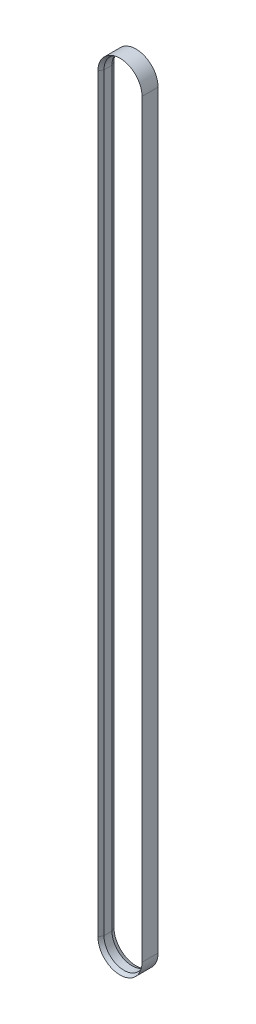
ISO-10303-21;
HEADER;
FILE_DESCRIPTION(('STEP AP214'),'2;1');
FILE_NAME('part.step','',(''),(''),'','','');
FILE_SCHEMA(('AUTOMOTIVE_DESIGN { 1 0 10303 214 1 1 1 1 }'));
ENDSEC;
DATA;
#1=APPLICATION_CONTEXT('core data for automotive mechanical design processes');
#2=APPLICATION_PROTOCOL_DEFINITION('international standard','automotive_design',2000,#1);
#3=PRODUCT_CONTEXT('',#1,'mechanical');
#4=PRODUCT('Part','Part','',(#3));
#5=PRODUCT_RELATED_PRODUCT_CATEGORY('part','',(#4));
#6=PRODUCT_DEFINITION_FORMATION('','',#4);
#7=PRODUCT_DEFINITION_CONTEXT('part definition',#1,'design');
#8=PRODUCT_DEFINITION('design','',#6,#7);
#9=PRODUCT_DEFINITION_SHAPE('','',#8);
#10=(LENGTH_UNIT() NAMED_UNIT(*) SI_UNIT(.MILLI.,.METRE.));
#11=(NAMED_UNIT(*) PLANE_ANGLE_UNIT() SI_UNIT($,.RADIAN.));
#12=(NAMED_UNIT(*) SI_UNIT($,.STERADIAN.) SOLID_ANGLE_UNIT());
#13=UNCERTAINTY_MEASURE_WITH_UNIT(LENGTH_MEASURE(1.E-05),#10,'distance_accuracy_value','');
#14=(GEOMETRIC_REPRESENTATION_CONTEXT(3) GLOBAL_UNCERTAINTY_ASSIGNED_CONTEXT((#13)) GLOBAL_UNIT_ASSIGNED_CONTEXT((#10,
#11,#12)) REPRESENTATION_CONTEXT('',''));
#15=CARTESIAN_POINT('',(0.,0.,0.));
#16=DIRECTION('',(0.,0.,1.));
#17=DIRECTION('',(1.,0.,0.));
#18=AXIS2_PLACEMENT_3D('',#15,#16,#17);
#19=CARTESIAN_POINT('',(27.5000000000167,-935.500000000115,10.));
#20=DIRECTION('',(1.,0.,0.));
#21=DIRECTION('',(0.,0.,-1.));
#22=AXIS2_PLACEMENT_3D('',#19,#20,#21);
#23=PLANE('',#22);
#24=DIRECTION('',(0.,1.,0.));
#25=VECTOR('',#24,1.);
#26=CARTESIAN_POINT('',(27.5000000000167,-935.500000000115,10.));
#27=LINE('',#26,#25);
#28=CARTESIAN_POINT('',(27.5000000000167,-935.500000000116,10.));
#29=VERTEX_POINT('',#28);
#30=CARTESIAN_POINT('',(27.5000000000167,0.,10.));
#31=VERTEX_POINT('',#30);
#32=EDGE_CURVE('E11',#29,#31,#27,.T.);
#33=ORIENTED_EDGE('',*,*,#32,.F.);
#34=DIRECTION('',(0.,0.,-1.));
#35=VECTOR('',#34,1.);
#36=CARTESIAN_POINT('',(27.5000000000167,-935.500000000116,10.));
#37=LINE('',#36,#35);
#38=CARTESIAN_POINT('',(27.5000000000167,-935.500000000116,-10.));
#39=VERTEX_POINT('',#38);
#40=EDGE_CURVE('E43',#29,#39,#37,.T.);
#41=ORIENTED_EDGE('',*,*,#40,.T.);
#42=DIRECTION('',(0.,1.,0.));
#43=VECTOR('',#42,1.);
#44=CARTESIAN_POINT('',(27.5000000000167,-935.500000000115,-10.));
#45=LINE('',#44,#43);
#46=CARTESIAN_POINT('',(27.5000000000167,0.,-10.));
#47=VERTEX_POINT('',#46);
#48=EDGE_CURVE('E128',#39,#47,#45,.T.);
#49=ORIENTED_EDGE('',*,*,#48,.T.);
#50=DIRECTION('',(0.,0.,-1.));
#51=VECTOR('',#50,1.);
#52=CARTESIAN_POINT('',(27.5000000000167,0.,10.));
#53=LINE('',#52,#51);
#54=EDGE_CURVE('E131',#31,#47,#53,.T.);
#55=ORIENTED_EDGE('',*,*,#54,.F.);
#56=EDGE_LOOP('',(#33,#41,#49,#55));
#57=FACE_BOUND('',#56,.T.);
#58=ADVANCED_FACE('F40',(#57),#23,.T.);
#59=CARTESIAN_POINT('',(25.0000000000166,-935.500000000115,5.));
#60=DIRECTION('',(-0.894427190999916,0.,0.447213595499959));
#61=DIRECTION('',(0.447213595499959,0.,0.894427190999916));
#62=AXIS2_PLACEMENT_3D('',#59,#60,#61);
#63=PLANE('',#62);
#64=DIRECTION('',(0.,1.,0.));
#65=VECTOR('',#64,1.);
#66=CARTESIAN_POINT('',(25.0000000000166,-935.500000000115,5.));
#67=LINE('',#66,#65);
#68=CARTESIAN_POINT('',(25.0000000000166,-935.500000000116,5.));
#69=VERTEX_POINT('',#68);
#70=CARTESIAN_POINT('',(25.0000000000166,0.,5.));
#71=VERTEX_POINT('',#70);
#72=EDGE_CURVE('E48',#69,#71,#67,.T.);
#73=ORIENTED_EDGE('',*,*,#72,.F.);
#74=DIRECTION('',(0.447213595499959,0.,0.894427190999916));
#75=VECTOR('',#74,1.);
#76=CARTESIAN_POINT('',(25.0000000000166,-935.500000000116,5.));
#77=LINE('',#76,#75);
#78=EDGE_CURVE('E198',#69,#29,#77,.T.);
#79=ORIENTED_EDGE('',*,*,#78,.T.);
#80=ORIENTED_EDGE('',*,*,#32,.T.);
#81=DIRECTION('',(0.447213595499959,0.,0.894427190999916));
#82=VECTOR('',#81,1.);
#83=CARTESIAN_POINT('',(25.0000000000166,0.,5.));
#84=LINE('',#83,#82);
#85=EDGE_CURVE('E156',#71,#31,#84,.T.);
#86=ORIENTED_EDGE('',*,*,#85,.F.);
#87=EDGE_LOOP('',(#73,#79,#80,#86));
#88=FACE_BOUND('',#87,.T.);
#89=ADVANCED_FACE('F222',(#88),#63,.T.);
#90=CARTESIAN_POINT('',(25.0000000000166,-935.500000000115,-5.));
#91=DIRECTION('',(-1.,0.,0.));
#92=DIRECTION('',(0.,0.,1.));
#93=AXIS2_PLACEMENT_3D('',#90,#91,#92);
#94=PLANE('',#93);
#95=DIRECTION('',(0.,1.,0.));
#96=VECTOR('',#95,1.);
#97=CARTESIAN_POINT('',(25.0000000000166,-935.500000000115,-5.));
#98=LINE('',#97,#96);
#99=CARTESIAN_POINT('',(25.0000000000166,-935.500000000116,-5.));
#100=VERTEX_POINT('',#99);
#101=CARTESIAN_POINT('',(25.0000000000166,0.,-5.));
#102=VERTEX_POINT('',#101);
#103=EDGE_CURVE('E137',#100,#102,#98,.T.);
#104=ORIENTED_EDGE('',*,*,#103,.F.);
#105=DIRECTION('',(0.,0.,1.));
#106=VECTOR('',#105,1.);
#107=CARTESIAN_POINT('',(25.0000000000166,-935.500000000116,-5.));
#108=LINE('',#107,#106);
#109=EDGE_CURVE('E182',#100,#69,#108,.T.);
#110=ORIENTED_EDGE('',*,*,#109,.T.);
#111=ORIENTED_EDGE('',*,*,#72,.T.);
#112=DIRECTION('',(0.,0.,1.));
#113=VECTOR('',#112,1.);
#114=CARTESIAN_POINT('',(25.0000000000166,0.,-5.));
#115=LINE('',#114,#113);
#116=EDGE_CURVE('E160',#102,#71,#115,.T.);
#117=ORIENTED_EDGE('',*,*,#116,.F.);
#118=EDGE_LOOP('',(#104,#110,#111,#117));
#119=FACE_BOUND('',#118,.T.);
#120=ADVANCED_FACE('F227',(#119),#94,.T.);
#121=CARTESIAN_POINT('',(5.99520433297585E-12,-935.500000000016,0.));
#122=DIRECTION('',(0.,0.,1.));
#123=DIRECTION('',(1.,0.,0.));
#124=AXIS2_PLACEMENT_3D('',#121,#122,#123);
#125=CYLINDRICAL_SURFACE('',#124,27.5000000000107);
#126=ORIENTED_EDGE('',*,*,#40,.F.);
#127=CARTESIAN_POINT('',(5.99520433297585E-12,-935.500000000016,10.));
#128=DIRECTION('',(0.,0.,1.));
#129=DIRECTION('',(-1.,3.62941999686411E-12,0.));
#130=AXIS2_PLACEMENT_3D('',#127,#128,#129);
#131=CIRCLE('',#130,27.5000000000107);
#132=CARTESIAN_POINT('',(-27.5000000000167,-935.499999999916,10.));
#133=VERTEX_POINT('',#132);
#134=EDGE_CURVE('E84',#133,#29,#131,.T.);
#135=ORIENTED_EDGE('',*,*,#134,.F.);
#136=DIRECTION('',(0.,0.,-1.));
#137=VECTOR('',#136,1.);
#138=CARTESIAN_POINT('',(-27.5000000000047,-935.499999999916,10.));
#139=LINE('',#138,#137);
#140=CARTESIAN_POINT('',(-27.5000000000167,-935.499999999916,-10.));
#141=VERTEX_POINT('',#140);
#142=EDGE_CURVE('E185',#133,#141,#139,.T.);
#143=ORIENTED_EDGE('',*,*,#142,.T.);
#144=CARTESIAN_POINT('',(5.99520433297585E-12,-935.500000000016,-10.));
#145=DIRECTION('',(0.,0.,1.));
#146=DIRECTION('',(-1.,3.62941999686411E-12,0.));
#147=AXIS2_PLACEMENT_3D('',#144,#145,#146);
#148=CIRCLE('',#147,27.5000000000107);
#149=EDGE_CURVE('E180',#141,#39,#148,.T.);
#150=ORIENTED_EDGE('',*,*,#149,.T.);
#151=EDGE_LOOP('',(#126,#135,#143,#150));
#152=FACE_BOUND('',#151,.T.);
#153=ADVANCED_FACE('F211',(#152),#125,.T.);
#154=CARTESIAN_POINT('',(5.99520433297585E-12,-935.500000000016,5.));
#155=DIRECTION('',(0.,0.,1.));
#156=DIRECTION('',(1.,0.,0.));
#157=AXIS2_PLACEMENT_3D('',#154,#155,#156);
#158=CONICAL_SURFACE('',#157,25.0000000000107,0.463647609000807);
#159=ORIENTED_EDGE('',*,*,#134,.T.);
#160=ORIENTED_EDGE('',*,*,#78,.F.);
#161=CARTESIAN_POINT('',(5.99520433297585E-12,-935.500000000016,5.));
#162=DIRECTION('',(0.,0.,1.));
#163=DIRECTION('',(-1.,3.99236199655036E-12,0.));
#164=AXIS2_PLACEMENT_3D('',#161,#162,#163);
#165=CIRCLE('',#164,25.0000000000107);
#166=CARTESIAN_POINT('',(-25.0000000000166,-935.499999999917,5.));
#167=VERTEX_POINT('',#166);
#168=EDGE_CURVE('E93',#167,#69,#165,.T.);
#169=ORIENTED_EDGE('',*,*,#168,.F.);
#170=DIRECTION('',(-0.447213595499959,0.,0.894427190999916));
#171=VECTOR('',#170,1.);
#172=CARTESIAN_POINT('',(-25.0000000000047,-935.499999999917,5.));
#173=LINE('',#172,#171);
#174=EDGE_CURVE('E194',#167,#133,#173,.T.);
#175=ORIENTED_EDGE('',*,*,#174,.T.);
#176=EDGE_LOOP('',(#159,#160,#169,#175));
#177=FACE_BOUND('',#176,.T.);
#178=ADVANCED_FACE('F221',(#177),#158,.F.);
#179=CARTESIAN_POINT('',(5.99520433297585E-12,-935.500000000016,0.));
#180=DIRECTION('',(0.,0.,1.));
#181=DIRECTION('',(1.,0.,0.));
#182=AXIS2_PLACEMENT_3D('',#179,#180,#181);
#183=CYLINDRICAL_SURFACE('',#182,25.0000000000107);
#184=ORIENTED_EDGE('',*,*,#168,.T.);
#185=ORIENTED_EDGE('',*,*,#109,.F.);
#186=CARTESIAN_POINT('',(5.99520433297585E-12,-935.500000000016,-5.));
#187=DIRECTION('',(0.,0.,1.));
#188=DIRECTION('',(-1.,3.99236199655036E-12,0.));
#189=AXIS2_PLACEMENT_3D('',#186,#187,#188);
#190=CIRCLE('',#189,25.0000000000107);
#191=CARTESIAN_POINT('',(-25.0000000000166,-935.499999999917,-5.));
#192=VERTEX_POINT('',#191);
#193=EDGE_CURVE('E101',#192,#100,#190,.T.);
#194=ORIENTED_EDGE('',*,*,#193,.F.);
#195=DIRECTION('',(0.,0.,1.));
#196=VECTOR('',#195,1.);
#197=CARTESIAN_POINT('',(-25.0000000000047,-935.499999999917,-5.));
#198=LINE('',#197,#196);
#199=EDGE_CURVE('E174',#192,#167,#198,.T.);
#200=ORIENTED_EDGE('',*,*,#199,.T.);
#201=EDGE_LOOP('',(#184,#185,#194,#200));
#202=FACE_BOUND('',#201,.T.);
#203=ADVANCED_FACE('F228',(#202),#183,.F.);
#204=CARTESIAN_POINT('',(5.99520433297585E-12,-935.500000000016,-10.));
#205=DIRECTION('',(0.,0.,-1.));
#206=DIRECTION('',(-1.,0.,0.));
#207=AXIS2_PLACEMENT_3D('',#204,#205,#206);
#208=CONICAL_SURFACE('',#207,27.5000000000107,0.463647609000806);
#209=ORIENTED_EDGE('',*,*,#193,.T.);
#210=DIRECTION('',(-0.447213595499958,0.,0.894427190999916));
#211=VECTOR('',#210,1.);
#212=CARTESIAN_POINT('',(27.5000000000167,-935.500000000116,-10.));
#213=LINE('',#212,#211);
#214=EDGE_CURVE('E178',#39,#100,#213,.T.);
#215=ORIENTED_EDGE('',*,*,#214,.F.);
#216=ORIENTED_EDGE('',*,*,#149,.F.);
#217=DIRECTION('',(0.447213595499958,0.,0.894427190999916));
#218=VECTOR('',#217,1.);
#219=CARTESIAN_POINT('',(-27.5000000000047,-935.499999999916,-10.));
#220=LINE('',#219,#218);
#221=EDGE_CURVE('E169',#141,#192,#220,.T.);
#222=ORIENTED_EDGE('',*,*,#221,.T.);
#223=EDGE_LOOP('',(#209,#215,#216,#222));
#224=FACE_BOUND('',#223,.T.);
#225=ADVANCED_FACE('F229',(#224),#208,.F.);
#226=CARTESIAN_POINT('',(-27.5000000000167,1.14460282876545E-12,10.));
#227=DIRECTION('',(-1.,0.,0.));
#228=DIRECTION('',(0.,0.,1.));
#229=AXIS2_PLACEMENT_3D('',#226,#227,#228);
#230=PLANE('',#229);
#231=ORIENTED_EDGE('',*,*,#142,.F.);
#232=DIRECTION('',(0.,-1.,0.));
#233=VECTOR('',#232,1.);
#234=CARTESIAN_POINT('',(-27.5000000000167,1.14460282876545E-12,10.));
#235=LINE('',#234,#233);
#236=CARTESIAN_POINT('',(-27.5000000000047,1.14578727095997E-12,10.));
#237=VERTEX_POINT('',#236);
#238=EDGE_CURVE('E204',#237,#133,#235,.T.);
#239=ORIENTED_EDGE('',*,*,#238,.F.);
#240=DIRECTION('',(0.,0.,-1.));
#241=VECTOR('',#240,1.);
#242=CARTESIAN_POINT('',(-27.5000000000167,1.14460282876545E-12,10.));
#243=LINE('',#242,#241);
#244=CARTESIAN_POINT('',(-27.5000000000047,1.14578727096E-12,-10.));
#245=VERTEX_POINT('',#244);
#246=EDGE_CURVE('E177',#237,#245,#243,.T.);
#247=ORIENTED_EDGE('',*,*,#246,.T.);
#248=DIRECTION('',(0.,-1.,0.));
#249=VECTOR('',#248,1.);
#250=CARTESIAN_POINT('',(-27.5000000000167,1.14460282876545E-12,-10.));
#251=LINE('',#250,#249);
#252=EDGE_CURVE('E172',#245,#141,#251,.T.);
#253=ORIENTED_EDGE('',*,*,#252,.T.);
#254=EDGE_LOOP('',(#231,#239,#247,#253));
#255=FACE_BOUND('',#254,.T.);
#256=ADVANCED_FACE('F216',(#255),#230,.T.);
#257=CARTESIAN_POINT('',(-25.0000000000166,1.04054802615048E-12,5.));
#258=DIRECTION('',(0.894427190999916,0.,0.447213595499959));
#259=DIRECTION('',(0.447213595499959,0.,-0.894427190999916));
#260=AXIS2_PLACEMENT_3D('',#257,#258,#259);
#261=PLANE('',#260);
#262=ORIENTED_EDGE('',*,*,#238,.T.);
#263=ORIENTED_EDGE('',*,*,#174,.F.);
#264=DIRECTION('',(0.,-1.,0.));
#265=VECTOR('',#264,1.);
#266=CARTESIAN_POINT('',(-25.0000000000166,1.04054802615048E-12,5.));
#267=LINE('',#266,#265);
#268=CARTESIAN_POINT('',(-25.0000000000047,1.04667126006084E-12,5.));
#269=VERTEX_POINT('',#268);
#270=EDGE_CURVE('E113',#269,#167,#267,.T.);
#271=ORIENTED_EDGE('',*,*,#270,.F.);
#272=DIRECTION('',(-0.447213595499959,0.,0.894427190999916));
#273=VECTOR('',#272,1.);
#274=CARTESIAN_POINT('',(-25.0000000000166,1.04054802615048E-12,5.));
#275=LINE('',#274,#273);
#276=EDGE_CURVE('E191',#269,#237,#275,.T.);
#277=ORIENTED_EDGE('',*,*,#276,.T.);
#278=EDGE_LOOP('',(#262,#263,#271,#277));
#279=FACE_BOUND('',#278,.T.);
#280=ADVANCED_FACE('F220',(#279),#261,.T.);
#281=CARTESIAN_POINT('',(-25.0000000000166,1.04054802615048E-12,-5.));
#282=DIRECTION('',(1.,0.,0.));
#283=DIRECTION('',(0.,0.,-1.));
#284=AXIS2_PLACEMENT_3D('',#281,#282,#283);
#285=PLANE('',#284);
#286=ORIENTED_EDGE('',*,*,#270,.T.);
#287=ORIENTED_EDGE('',*,*,#199,.F.);
#288=DIRECTION('',(0.,-1.,0.));
#289=VECTOR('',#288,1.);
#290=CARTESIAN_POINT('',(-25.0000000000166,1.04054802615048E-12,-5.));
#291=LINE('',#290,#289);
#292=CARTESIAN_POINT('',(-25.0000000000047,1.04667126006084E-12,-5.));
#293=VERTEX_POINT('',#292);
#294=EDGE_CURVE('E119',#293,#192,#291,.T.);
#295=ORIENTED_EDGE('',*,*,#294,.F.);
#296=DIRECTION('',(0.,0.,1.));
#297=VECTOR('',#296,1.);
#298=CARTESIAN_POINT('',(-25.0000000000166,1.04054802615048E-12,-5.));
#299=LINE('',#298,#297);
#300=EDGE_CURVE('E167',#293,#269,#299,.T.);
#301=ORIENTED_EDGE('',*,*,#300,.T.);
#302=EDGE_LOOP('',(#286,#287,#295,#301));
#303=FACE_BOUND('',#302,.T.);
#304=ADVANCED_FACE('F285',(#303),#285,.T.);
#305=CARTESIAN_POINT('',(-27.5000000000167,1.14460282876545E-12,-10.));
#306=DIRECTION('',(0.894427190999916,0.,-0.447213595499958));
#307=DIRECTION('',(-0.447213595499958,0.,-0.894427190999916));
#308=AXIS2_PLACEMENT_3D('',#305,#306,#307);
#309=PLANE('',#308);
#310=ORIENTED_EDGE('',*,*,#294,.T.);
#311=ORIENTED_EDGE('',*,*,#221,.F.);
#312=ORIENTED_EDGE('',*,*,#252,.F.);
#313=DIRECTION('',(0.447213595499958,0.,0.894427190999916));
#314=VECTOR('',#313,1.);
#315=CARTESIAN_POINT('',(-27.5000000000167,1.14460282876545E-12,-10.));
#316=LINE('',#315,#314);
#317=EDGE_CURVE('E148',#245,#293,#316,.T.);
#318=ORIENTED_EDGE('',*,*,#317,.T.);
#319=EDGE_LOOP('',(#310,#311,#312,#318));
#320=FACE_BOUND('',#319,.T.);
#321=ADVANCED_FACE('F214',(#320),#309,.T.);
#322=CARTESIAN_POINT('',(5.99520433297585E-12,9.98645610650328E-11,0.));
#323=DIRECTION('',(0.,0.,1.));
#324=DIRECTION('',(1.,0.,0.));
#325=AXIS2_PLACEMENT_3D('',#322,#323,#324);
#326=CYLINDRICAL_SURFACE('',#325,27.5000000000107);
#327=ORIENTED_EDGE('',*,*,#246,.F.);
#328=CARTESIAN_POINT('',(5.99520433297585E-12,9.98645610650328E-11,10.));
#329=DIRECTION('',(0.,0.,1.));
#330=DIRECTION('',(1.,-3.6314385841816E-12,0.));
#331=AXIS2_PLACEMENT_3D('',#328,#329,#330);
#332=CIRCLE('',#331,27.5000000000107);
#333=EDGE_CURVE('E155',#31,#237,#332,.T.);
#334=ORIENTED_EDGE('',*,*,#333,.F.);
#335=ORIENTED_EDGE('',*,*,#54,.T.);
#336=CARTESIAN_POINT('',(5.99520433297585E-12,9.98645610650328E-11,-10.));
#337=DIRECTION('',(0.,0.,1.));
#338=DIRECTION('',(1.,-3.63143858418161E-12,0.));
#339=AXIS2_PLACEMENT_3D('',#336,#337,#338);
#340=CIRCLE('',#339,27.5000000000107);
#341=EDGE_CURVE('E143',#47,#245,#340,.T.);
#342=ORIENTED_EDGE('',*,*,#341,.T.);
#343=EDGE_LOOP('',(#327,#334,#335,#342));
#344=FACE_BOUND('',#343,.T.);
#345=ADVANCED_FACE('F153',(#344),#326,.T.);
#346=CARTESIAN_POINT('',(5.99520433297585E-12,9.98645610650328E-11,5.));
#347=DIRECTION('',(0.,0.,1.));
#348=DIRECTION('',(1.,0.,0.));
#349=AXIS2_PLACEMENT_3D('',#346,#347,#348);
#350=CONICAL_SURFACE('',#349,25.0000000000107,0.463647609000807);
#351=ORIENTED_EDGE('',*,*,#333,.T.);
#352=ORIENTED_EDGE('',*,*,#276,.F.);
#353=CARTESIAN_POINT('',(5.99520433297585E-12,9.98645610650328E-11,5.));
#354=DIRECTION('',(0.,0.,1.));
#355=DIRECTION('',(1.,-3.99458244259961E-12,0.));
#356=AXIS2_PLACEMENT_3D('',#353,#354,#355);
#357=CIRCLE('',#356,25.0000000000107);
#358=EDGE_CURVE('E188',#71,#269,#357,.T.);
#359=ORIENTED_EDGE('',*,*,#358,.F.);
#360=ORIENTED_EDGE('',*,*,#85,.T.);
#361=EDGE_LOOP('',(#351,#352,#359,#360));
#362=FACE_BOUND('',#361,.T.);
#363=ADVANCED_FACE('F218',(#362),#350,.F.);
#364=CARTESIAN_POINT('',(5.99520433297585E-12,9.98645610650328E-11,0.));
#365=DIRECTION('',(0.,0.,1.));
#366=DIRECTION('',(1.,0.,0.));
#367=AXIS2_PLACEMENT_3D('',#364,#365,#366);
#368=CYLINDRICAL_SURFACE('',#367,25.0000000000107);
#369=ORIENTED_EDGE('',*,*,#358,.T.);
#370=ORIENTED_EDGE('',*,*,#300,.F.);
#371=CARTESIAN_POINT('',(5.99520433297585E-12,9.98645610650328E-11,-5.));
#372=DIRECTION('',(0.,0.,1.));
#373=DIRECTION('',(1.,-3.99458244259961E-12,0.));
#374=AXIS2_PLACEMENT_3D('',#371,#372,#373);
#375=CIRCLE('',#374,25.0000000000107);
#376=EDGE_CURVE('E166',#102,#293,#375,.T.);
#377=ORIENTED_EDGE('',*,*,#376,.F.);
#378=ORIENTED_EDGE('',*,*,#116,.T.);
#379=EDGE_LOOP('',(#369,#370,#377,#378));
#380=FACE_BOUND('',#379,.T.);
#381=ADVANCED_FACE('F225',(#380),#368,.F.);
#382=CARTESIAN_POINT('',(5.99520433297585E-12,9.98645610650328E-11,-10.));
#383=DIRECTION('',(0.,0.,-1.));
#384=DIRECTION('',(-1.,0.,0.));
#385=AXIS2_PLACEMENT_3D('',#382,#383,#384);
#386=CONICAL_SURFACE('',#385,27.5000000000107,0.463647609000806);
#387=ORIENTED_EDGE('',*,*,#376,.T.);
#388=ORIENTED_EDGE('',*,*,#317,.F.);
#389=ORIENTED_EDGE('',*,*,#341,.F.);
#390=DIRECTION('',(-0.447213595499958,0.,0.894427190999916));
#391=VECTOR('',#390,1.);
#392=CARTESIAN_POINT('',(27.5000000000167,0.,-10.));
#393=LINE('',#392,#391);
#394=EDGE_CURVE('E146',#47,#102,#393,.T.);
#395=ORIENTED_EDGE('',*,*,#394,.T.);
#396=EDGE_LOOP('',(#387,#388,#389,#395));
#397=FACE_BOUND('',#396,.T.);
#398=ADVANCED_FACE('F145',(#397),#386,.F.);
#399=CARTESIAN_POINT('',(27.5000000000167,-935.500000000115,-10.));
#400=DIRECTION('',(-0.894427190999916,0.,-0.447213595499958));
#401=DIRECTION('',(-0.447213595499958,0.,0.894427190999916));
#402=AXIS2_PLACEMENT_3D('',#399,#400,#401);
#403=PLANE('',#402);
#404=ORIENTED_EDGE('',*,*,#214,.T.);
#405=ORIENTED_EDGE('',*,*,#103,.T.);
#406=ORIENTED_EDGE('',*,*,#394,.F.);
#407=ORIENTED_EDGE('',*,*,#48,.F.);
#408=EDGE_LOOP('',(#404,#405,#406,#407));
#409=FACE_BOUND('',#408,.T.);
#410=ADVANCED_FACE('F158',(#409),#403,.T.);
#411=CLOSED_SHELL('',(#58,#89,#120,#153,#178,#203,#225,#256,#280,#304,#321,#345,#363,#381,#398,#410));
#412=MANIFOLD_SOLID_BREP('B2',#411);
#413=ADVANCED_BREP_SHAPE_REPRESENTATION('',(#18,#412),#14);
#414=SHAPE_DEFINITION_REPRESENTATION(#9,#413);
ENDSEC;
END-ISO-10303-21;
